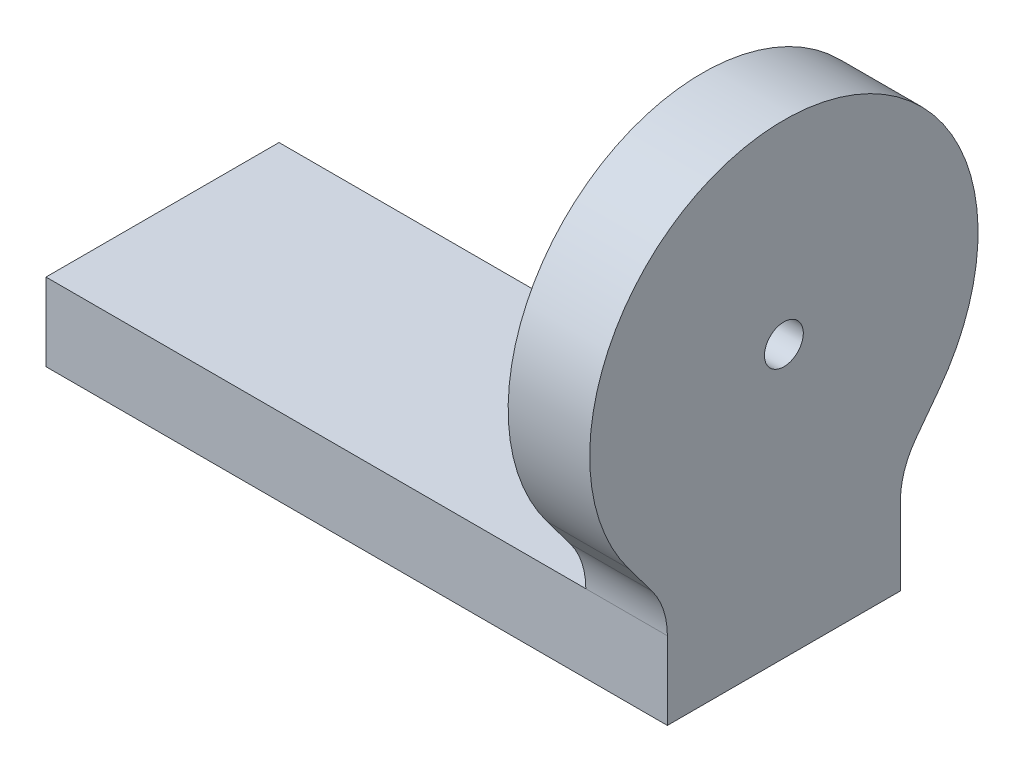
ISO-10303-21;
HEADER;
FILE_DESCRIPTION(('STEP AP214'),'2;1');
FILE_NAME('part.step','',(''),(''),'','','');
FILE_SCHEMA(('AUTOMOTIVE_DESIGN { 1 0 10303 214 1 1 1 1 }'));
ENDSEC;
DATA;
#1=APPLICATION_CONTEXT('core data for automotive mechanical design processes');
#2=APPLICATION_PROTOCOL_DEFINITION('international standard','automotive_design',2000,#1);
#3=PRODUCT_CONTEXT('',#1,'mechanical');
#4=PRODUCT('Part','Part','',(#3));
#5=PRODUCT_RELATED_PRODUCT_CATEGORY('part','',(#4));
#6=PRODUCT_DEFINITION_FORMATION('','',#4);
#7=PRODUCT_DEFINITION_CONTEXT('part definition',#1,'design');
#8=PRODUCT_DEFINITION('design','',#6,#7);
#9=PRODUCT_DEFINITION_SHAPE('','',#8);
#10=(LENGTH_UNIT() NAMED_UNIT(*) SI_UNIT(.MILLI.,.METRE.));
#11=(NAMED_UNIT(*) PLANE_ANGLE_UNIT() SI_UNIT($,.RADIAN.));
#12=(NAMED_UNIT(*) SI_UNIT($,.STERADIAN.) SOLID_ANGLE_UNIT());
#13=UNCERTAINTY_MEASURE_WITH_UNIT(LENGTH_MEASURE(1.E-05),#10,'distance_accuracy_value','');
#14=(GEOMETRIC_REPRESENTATION_CONTEXT(3) GLOBAL_UNCERTAINTY_ASSIGNED_CONTEXT((#13)) GLOBAL_UNIT_ASSIGNED_CONTEXT((#10,
#11,#12)) REPRESENTATION_CONTEXT('',''));
#15=CARTESIAN_POINT('',(0.,0.,0.));
#16=DIRECTION('',(0.,0.,1.));
#17=DIRECTION('',(1.,0.,0.));
#18=AXIS2_PLACEMENT_3D('',#15,#16,#17);
#19=CARTESIAN_POINT('',(29.5,60.,-50.));
#20=DIRECTION('',(-1.,0.,0.));
#21=DIRECTION('',(0.,0.,1.));
#22=AXIS2_PLACEMENT_3D('',#19,#20,#21);
#23=PLANE('',#22);
#24=CARTESIAN_POINT('',(29.5,35.,-25.));
#25=DIRECTION('',(-1.,0.,0.));
#26=DIRECTION('',(0.,0.,1.));
#27=AXIS2_PLACEMENT_3D('',#24,#25,#26);
#28=CIRCLE('',#27,2.5);
#29=CARTESIAN_POINT('',(29.5,35.,-22.5));
#30=VERTEX_POINT('',#29);
#31=EDGE_CURVE('E169',#30,#30,#28,.T.);
#32=ORIENTED_EDGE('',*,*,#31,.F.);
#33=EDGE_LOOP('',(#32));
#34=FACE_BOUND('',#33,.T.);
#35=DIRECTION('',(0.,-0.800010129343293,-0.599986493971429));
#36=VECTOR('',#35,1.);
#37=CARTESIAN_POINT('',(29.5,9.59970286834054,-12.800054018756));
#38=LINE('',#37,#36);
#39=CARTESIAN_POINT('',(29.5,19.9484136276116,-5.03879393236643));
#40=VERTEX_POINT('',#39);
#41=CARTESIAN_POINT('',(29.5,16.,-8.));
#42=VERTEX_POINT('',#41);
#43=EDGE_CURVE('E114',#40,#42,#38,.T.);
#44=ORIENTED_EDGE('',*,*,#43,.F.);
#45=CARTESIAN_POINT('',(29.5,35.,-25.));
#46=DIRECTION('',(-1.,0.,0.));
#47=DIRECTION('',(0.,0.,1.));
#48=AXIS2_PLACEMENT_3D('',#45,#46,#47);
#49=CIRCLE('',#48,25.);
#50=CARTESIAN_POINT('',(29.5,20.,-45.));
#51=VERTEX_POINT('',#50);
#52=EDGE_CURVE('E174',#40,#51,#49,.T.);
#53=ORIENTED_EDGE('',*,*,#52,.T.);
#54=DIRECTION('',(0.,-0.799999999999999,0.600000000000001));
#55=VECTOR('',#54,1.);
#56=CARTESIAN_POINT('',(29.5,-14.4,-19.1999999999999));
#57=LINE('',#56,#55);
#58=CARTESIAN_POINT('',(29.5,16.,-42.));
#59=VERTEX_POINT('',#58);
#60=EDGE_CURVE('E143',#51,#59,#57,.T.);
#61=ORIENTED_EDGE('',*,*,#60,.T.);
#62=CARTESIAN_POINT('',(29.5,10.,-50.));
#63=DIRECTION('',(-1.,0.,0.));
#64=DIRECTION('',(0.,0.,1.));
#65=AXIS2_PLACEMENT_3D('',#62,#63,#64);
#66=CIRCLE('',#65,10.);
#67=CARTESIAN_POINT('',(29.5,10.,-40.));
#68=VERTEX_POINT('',#67);
#69=EDGE_CURVE('E137',#68,#59,#66,.T.);
#70=ORIENTED_EDGE('',*,*,#69,.F.);
#71=DIRECTION('',(0.,0.,1.));
#72=VECTOR('',#71,1.);
#73=CARTESIAN_POINT('',(29.5,10.,-50.));
#74=LINE('',#73,#72);
#75=CARTESIAN_POINT('',(29.5,10.,-10.));
#76=VERTEX_POINT('',#75);
#77=EDGE_CURVE('E42',#68,#76,#74,.T.);
#78=ORIENTED_EDGE('',*,*,#77,.T.);
#79=CARTESIAN_POINT('',(29.5,10.,0.));
#80=DIRECTION('',(-1.,0.,0.));
#81=DIRECTION('',(0.,0.,1.));
#82=AXIS2_PLACEMENT_3D('',#79,#80,#81);
#83=CIRCLE('',#82,10.);
#84=EDGE_CURVE('E132',#42,#76,#83,.T.);
#85=ORIENTED_EDGE('',*,*,#84,.F.);
#86=EDGE_LOOP('',(#44,#53,#61,#70,#78,#85));
#87=FACE_BOUND('',#86,.T.);
#88=ADVANCED_FACE('F33',(#34,#87),#23,.T.);
#89=CARTESIAN_POINT('',(40.,60.,-50.));
#90=DIRECTION('',(-1.,0.,0.));
#91=DIRECTION('',(0.,-1.,0.));
#92=AXIS2_PLACEMENT_3D('',#89,#90,#91);
#93=PLANE('',#92);
#94=CARTESIAN_POINT('',(40.,35.,-25.));
#95=DIRECTION('',(-1.,0.,0.));
#96=DIRECTION('',(0.,0.,1.));
#97=AXIS2_PLACEMENT_3D('',#94,#95,#96);
#98=CIRCLE('',#97,2.5);
#99=CARTESIAN_POINT('',(40.,35.,-22.5));
#100=VERTEX_POINT('',#99);
#101=EDGE_CURVE('E171',#100,#100,#98,.T.);
#102=ORIENTED_EDGE('',*,*,#101,.T.);
#103=EDGE_LOOP('',(#102));
#104=FACE_BOUND('',#103,.T.);
#105=CARTESIAN_POINT('',(40.,35.,-25.));
#106=DIRECTION('',(-1.,0.,0.));
#107=DIRECTION('',(0.,0.,1.));
#108=AXIS2_PLACEMENT_3D('',#105,#106,#107);
#109=CIRCLE('',#108,25.);
#110=CARTESIAN_POINT('',(40.,19.9484136276116,-5.03879393236643));
#111=VERTEX_POINT('',#110);
#112=CARTESIAN_POINT('',(40.,20.,-45.));
#113=VERTEX_POINT('',#112);
#114=EDGE_CURVE('E130',#111,#113,#109,.T.);
#115=ORIENTED_EDGE('',*,*,#114,.F.);
#116=DIRECTION('',(0.,-0.800010129343293,-0.599986493971429));
#117=VECTOR('',#116,1.);
#118=CARTESIAN_POINT('',(40.,9.59970286834054,-12.800054018756));
#119=LINE('',#118,#117);
#120=CARTESIAN_POINT('',(40.,16.,-8.));
#121=VERTEX_POINT('',#120);
#122=EDGE_CURVE('E112',#111,#121,#119,.T.);
#123=ORIENTED_EDGE('',*,*,#122,.T.);
#124=CARTESIAN_POINT('',(40.,10.,0.));
#125=DIRECTION('',(-1.,0.,0.));
#126=DIRECTION('',(0.,0.,1.));
#127=AXIS2_PLACEMENT_3D('',#124,#125,#126);
#128=CIRCLE('',#127,10.);
#129=CARTESIAN_POINT('',(40.,10.,-10.));
#130=VERTEX_POINT('',#129);
#131=EDGE_CURVE('E118',#121,#130,#128,.T.);
#132=ORIENTED_EDGE('',*,*,#131,.T.);
#133=DIRECTION('',(0.,1.,0.));
#134=VECTOR('',#133,1.);
#135=CARTESIAN_POINT('',(40.,0.,-10.));
#136=LINE('',#135,#134);
#137=CARTESIAN_POINT('',(40.,0.,-10.));
#138=VERTEX_POINT('',#137);
#139=EDGE_CURVE('E157',#138,#130,#136,.T.);
#140=ORIENTED_EDGE('',*,*,#139,.F.);
#141=DIRECTION('',(0.,0.,1.));
#142=VECTOR('',#141,1.);
#143=CARTESIAN_POINT('',(40.,0.,-50.));
#144=LINE('',#143,#142);
#145=CARTESIAN_POINT('',(40.,0.,-40.));
#146=VERTEX_POINT('',#145);
#147=EDGE_CURVE('E180',#146,#138,#144,.T.);
#148=ORIENTED_EDGE('',*,*,#147,.F.);
#149=DIRECTION('',(0.,1.,0.));
#150=VECTOR('',#149,1.);
#151=CARTESIAN_POINT('',(40.,0.,-40.));
#152=LINE('',#151,#150);
#153=CARTESIAN_POINT('',(40.,10.,-40.));
#154=VERTEX_POINT('',#153);
#155=EDGE_CURVE('E58',#146,#154,#152,.T.);
#156=ORIENTED_EDGE('',*,*,#155,.T.);
#157=CARTESIAN_POINT('',(40.,10.,-50.));
#158=DIRECTION('',(-1.,0.,0.));
#159=DIRECTION('',(0.,0.,1.));
#160=AXIS2_PLACEMENT_3D('',#157,#158,#159);
#161=CIRCLE('',#160,10.);
#162=CARTESIAN_POINT('',(40.,16.,-42.));
#163=VERTEX_POINT('',#162);
#164=EDGE_CURVE('E139',#154,#163,#161,.T.);
#165=ORIENTED_EDGE('',*,*,#164,.T.);
#166=DIRECTION('',(0.,-0.799999999999999,0.600000000000001));
#167=VECTOR('',#166,1.);
#168=CARTESIAN_POINT('',(40.,-14.4,-19.1999999999999));
#169=LINE('',#168,#167);
#170=EDGE_CURVE('E142',#113,#163,#169,.T.);
#171=ORIENTED_EDGE('',*,*,#170,.F.);
#172=EDGE_LOOP('',(#115,#123,#132,#140,#148,#156,#165,#171));
#173=FACE_BOUND('',#172,.T.);
#174=ADVANCED_FACE('F128',(#104,#173),#93,.F.);
#175=CARTESIAN_POINT('',(-40.,10.,-50.));
#176=DIRECTION('',(-1.,0.,0.));
#177=DIRECTION('',(0.,0.,1.));
#178=AXIS2_PLACEMENT_3D('',#175,#176,#177);
#179=PLANE('',#178);
#180=DIRECTION('',(0.,1.,0.));
#181=VECTOR('',#180,1.);
#182=CARTESIAN_POINT('',(-40.,0.,-10.));
#183=LINE('',#182,#181);
#184=CARTESIAN_POINT('',(-40.,0.,-10.));
#185=VERTEX_POINT('',#184);
#186=CARTESIAN_POINT('',(-40.,10.,-10.));
#187=VERTEX_POINT('',#186);
#188=EDGE_CURVE('E50',#185,#187,#183,.T.);
#189=ORIENTED_EDGE('',*,*,#188,.T.);
#190=DIRECTION('',(0.,0.,1.));
#191=VECTOR('',#190,1.);
#192=CARTESIAN_POINT('',(-40.,10.,-50.));
#193=LINE('',#192,#191);
#194=CARTESIAN_POINT('',(-40.,10.,-40.));
#195=VERTEX_POINT('',#194);
#196=EDGE_CURVE('E11',#195,#187,#193,.T.);
#197=ORIENTED_EDGE('',*,*,#196,.F.);
#198=DIRECTION('',(0.,1.,0.));
#199=VECTOR('',#198,1.);
#200=CARTESIAN_POINT('',(-40.,0.,-40.));
#201=LINE('',#200,#199);
#202=CARTESIAN_POINT('',(-40.,0.,-40.));
#203=VERTEX_POINT('',#202);
#204=EDGE_CURVE('E164',#203,#195,#201,.T.);
#205=ORIENTED_EDGE('',*,*,#204,.F.);
#206=DIRECTION('',(0.,0.,1.));
#207=VECTOR('',#206,1.);
#208=CARTESIAN_POINT('',(-40.,0.,-50.));
#209=LINE('',#208,#207);
#210=EDGE_CURVE('E37',#203,#185,#209,.T.);
#211=ORIENTED_EDGE('',*,*,#210,.T.);
#212=EDGE_LOOP('',(#189,#197,#205,#211));
#213=FACE_BOUND('',#212,.T.);
#214=ADVANCED_FACE('F35',(#213),#179,.T.);
#215=CARTESIAN_POINT('',(-40.,10.,-50.));
#216=DIRECTION('',(0.,-1.,0.));
#217=DIRECTION('',(0.,0.,-1.));
#218=AXIS2_PLACEMENT_3D('',#215,#216,#217);
#219=PLANE('',#218);
#220=ORIENTED_EDGE('',*,*,#196,.T.);
#221=DIRECTION('',(-1.,0.,0.));
#222=VECTOR('',#221,1.);
#223=CARTESIAN_POINT('',(-40.,10.,-10.));
#224=LINE('',#223,#222);
#225=EDGE_CURVE('E153',#76,#187,#224,.T.);
#226=ORIENTED_EDGE('',*,*,#225,.F.);
#227=ORIENTED_EDGE('',*,*,#77,.F.);
#228=DIRECTION('',(1.,0.,0.));
#229=VECTOR('',#228,1.);
#230=CARTESIAN_POINT('',(-40.,10.,-40.));
#231=LINE('',#230,#229);
#232=EDGE_CURVE('E165',#195,#68,#231,.T.);
#233=ORIENTED_EDGE('',*,*,#232,.F.);
#234=EDGE_LOOP('',(#220,#226,#227,#233));
#235=FACE_BOUND('',#234,.T.);
#236=ADVANCED_FACE('F200',(#235),#219,.F.);
#237=CARTESIAN_POINT('',(-40.,0.,-50.));
#238=DIRECTION('',(0.,-1.,0.));
#239=DIRECTION('',(1.,0.,0.));
#240=AXIS2_PLACEMENT_3D('',#237,#238,#239);
#241=PLANE('',#240);
#242=DIRECTION('',(-1.,0.,0.));
#243=VECTOR('',#242,1.);
#244=CARTESIAN_POINT('',(-40.,0.,-10.));
#245=LINE('',#244,#243);
#246=EDGE_CURVE('E155',#138,#185,#245,.T.);
#247=ORIENTED_EDGE('',*,*,#246,.T.);
#248=ORIENTED_EDGE('',*,*,#210,.F.);
#249=DIRECTION('',(1.,0.,0.));
#250=VECTOR('',#249,1.);
#251=CARTESIAN_POINT('',(-40.,0.,-40.));
#252=LINE('',#251,#250);
#253=EDGE_CURVE('E162',#203,#146,#252,.T.);
#254=ORIENTED_EDGE('',*,*,#253,.T.);
#255=ORIENTED_EDGE('',*,*,#147,.T.);
#256=EDGE_LOOP('',(#247,#248,#254,#255));
#257=FACE_BOUND('',#256,.T.);
#258=ADVANCED_FACE('F189',(#257),#241,.T.);
#259=CARTESIAN_POINT('',(40.,35.,-25.));
#260=DIRECTION('',(-1.,0.,0.));
#261=DIRECTION('',(0.,0.,1.));
#262=AXIS2_PLACEMENT_3D('',#259,#260,#261);
#263=CYLINDRICAL_SURFACE('',#262,25.);
#264=ORIENTED_EDGE('',*,*,#52,.F.);
#265=DIRECTION('',(-1.,0.,0.));
#266=VECTOR('',#265,1.);
#267=CARTESIAN_POINT('',(40.,19.9484136276116,-5.03879393236643));
#268=LINE('',#267,#266);
#269=EDGE_CURVE('E117',#111,#40,#268,.T.);
#270=ORIENTED_EDGE('',*,*,#269,.F.);
#271=ORIENTED_EDGE('',*,*,#114,.T.);
#272=DIRECTION('',(-1.,0.,0.));
#273=VECTOR('',#272,1.);
#274=CARTESIAN_POINT('',(40.,20.,-45.));
#275=LINE('',#274,#273);
#276=EDGE_CURVE('E150',#113,#51,#275,.T.);
#277=ORIENTED_EDGE('',*,*,#276,.T.);
#278=EDGE_LOOP('',(#264,#270,#271,#277));
#279=FACE_BOUND('',#278,.T.);
#280=ADVANCED_FACE('F207',(#279),#263,.T.);
#281=CARTESIAN_POINT('',(40.,35.,-25.));
#282=DIRECTION('',(-1.,0.,0.));
#283=DIRECTION('',(0.,0.,1.));
#284=AXIS2_PLACEMENT_3D('',#281,#282,#283);
#285=CYLINDRICAL_SURFACE('',#284,2.5);
#286=ORIENTED_EDGE('',*,*,#101,.F.);
#287=EDGE_LOOP('',(#286));
#288=FACE_BOUND('',#287,.T.);
#289=ORIENTED_EDGE('',*,*,#31,.T.);
#290=EDGE_LOOP('',(#289));
#291=FACE_BOUND('',#290,.T.);
#292=ADVANCED_FACE('F209',(#288,#291),#285,.F.);
#293=CARTESIAN_POINT('',(-40.,0.,-40.));
#294=DIRECTION('',(0.,0.,1.));
#295=DIRECTION('',(1.,0.,0.));
#296=AXIS2_PLACEMENT_3D('',#293,#294,#295);
#297=PLANE('',#296);
#298=ORIENTED_EDGE('',*,*,#232,.T.);
#299=EDGE_CURVE('E160',#68,#154,#231,.T.);
#300=ORIENTED_EDGE('',*,*,#299,.T.);
#301=ORIENTED_EDGE('',*,*,#155,.F.);
#302=ORIENTED_EDGE('',*,*,#253,.F.);
#303=ORIENTED_EDGE('',*,*,#204,.T.);
#304=EDGE_LOOP('',(#298,#300,#301,#302,#303));
#305=FACE_BOUND('',#304,.T.);
#306=ADVANCED_FACE('F195',(#305),#297,.F.);
#307=CARTESIAN_POINT('',(-40.,0.,-10.));
#308=DIRECTION('',(0.,0.,-1.));
#309=DIRECTION('',(-1.,0.,0.));
#310=AXIS2_PLACEMENT_3D('',#307,#308,#309);
#311=PLANE('',#310);
#312=EDGE_CURVE('E123',#130,#76,#224,.T.);
#313=ORIENTED_EDGE('',*,*,#312,.T.);
#314=ORIENTED_EDGE('',*,*,#225,.T.);
#315=ORIENTED_EDGE('',*,*,#188,.F.);
#316=ORIENTED_EDGE('',*,*,#246,.F.);
#317=ORIENTED_EDGE('',*,*,#139,.T.);
#318=EDGE_LOOP('',(#313,#314,#315,#316,#317));
#319=FACE_BOUND('',#318,.T.);
#320=ADVANCED_FACE('F190',(#319),#311,.F.);
#321=CARTESIAN_POINT('',(40.,-14.4,-19.1999999999999));
#322=DIRECTION('',(0.,-0.600000000000001,-0.799999999999999));
#323=DIRECTION('',(0.,0.799999999999999,-0.600000000000001));
#324=AXIS2_PLACEMENT_3D('',#321,#322,#323);
#325=PLANE('',#324);
#326=ORIENTED_EDGE('',*,*,#60,.F.);
#327=ORIENTED_EDGE('',*,*,#276,.F.);
#328=ORIENTED_EDGE('',*,*,#170,.T.);
#329=DIRECTION('',(-1.,0.,0.));
#330=VECTOR('',#329,1.);
#331=CARTESIAN_POINT('',(40.,16.,-42.));
#332=LINE('',#331,#330);
#333=EDGE_CURVE('E145',#163,#59,#332,.T.);
#334=ORIENTED_EDGE('',*,*,#333,.T.);
#335=EDGE_LOOP('',(#326,#327,#328,#334));
#336=FACE_BOUND('',#335,.T.);
#337=ADVANCED_FACE('F205',(#336),#325,.T.);
#338=CARTESIAN_POINT('',(40.,10.,-50.));
#339=DIRECTION('',(-1.,0.,0.));
#340=DIRECTION('',(0.,0.,1.));
#341=AXIS2_PLACEMENT_3D('',#338,#339,#340);
#342=CYLINDRICAL_SURFACE('',#341,10.);
#343=ORIENTED_EDGE('',*,*,#69,.T.);
#344=ORIENTED_EDGE('',*,*,#333,.F.);
#345=ORIENTED_EDGE('',*,*,#164,.F.);
#346=ORIENTED_EDGE('',*,*,#299,.F.);
#347=EDGE_LOOP('',(#343,#344,#345,#346));
#348=FACE_BOUND('',#347,.T.);
#349=ADVANCED_FACE('F193',(#348),#342,.F.);
#350=CARTESIAN_POINT('',(40.,9.59970286834054,-12.800054018756));
#351=DIRECTION('',(0.,0.599986493971429,-0.800010129343293));
#352=DIRECTION('',(0.,0.800010129343293,0.599986493971429));
#353=AXIS2_PLACEMENT_3D('',#350,#351,#352);
#354=PLANE('',#353);
#355=ORIENTED_EDGE('',*,*,#43,.T.);
#356=DIRECTION('',(-1.,0.,0.));
#357=VECTOR('',#356,1.);
#358=CARTESIAN_POINT('',(40.,16.,-8.));
#359=LINE('',#358,#357);
#360=EDGE_CURVE('E107',#121,#42,#359,.T.);
#361=ORIENTED_EDGE('',*,*,#360,.F.);
#362=ORIENTED_EDGE('',*,*,#122,.F.);
#363=ORIENTED_EDGE('',*,*,#269,.T.);
#364=EDGE_LOOP('',(#355,#361,#362,#363));
#365=FACE_BOUND('',#364,.T.);
#366=ADVANCED_FACE('F109',(#365),#354,.F.);
#367=CARTESIAN_POINT('',(40.,10.,0.));
#368=DIRECTION('',(-1.,0.,0.));
#369=DIRECTION('',(0.,0.,1.));
#370=AXIS2_PLACEMENT_3D('',#367,#368,#369);
#371=CYLINDRICAL_SURFACE('',#370,10.);
#372=ORIENTED_EDGE('',*,*,#84,.T.);
#373=ORIENTED_EDGE('',*,*,#312,.F.);
#374=ORIENTED_EDGE('',*,*,#131,.F.);
#375=ORIENTED_EDGE('',*,*,#360,.T.);
#376=EDGE_LOOP('',(#372,#373,#374,#375));
#377=FACE_BOUND('',#376,.T.);
#378=ADVANCED_FACE('F121',(#377),#371,.F.);
#379=CLOSED_SHELL('',(#88,#174,#214,#236,#258,#280,#292,#306,#320,#337,#349,#366,#378));
#380=MANIFOLD_SOLID_BREP('B2',#379);
#381=ADVANCED_BREP_SHAPE_REPRESENTATION('',(#18,#380),#14);
#382=SHAPE_DEFINITION_REPRESENTATION(#9,#381);
ENDSEC;
END-ISO-10303-21;
